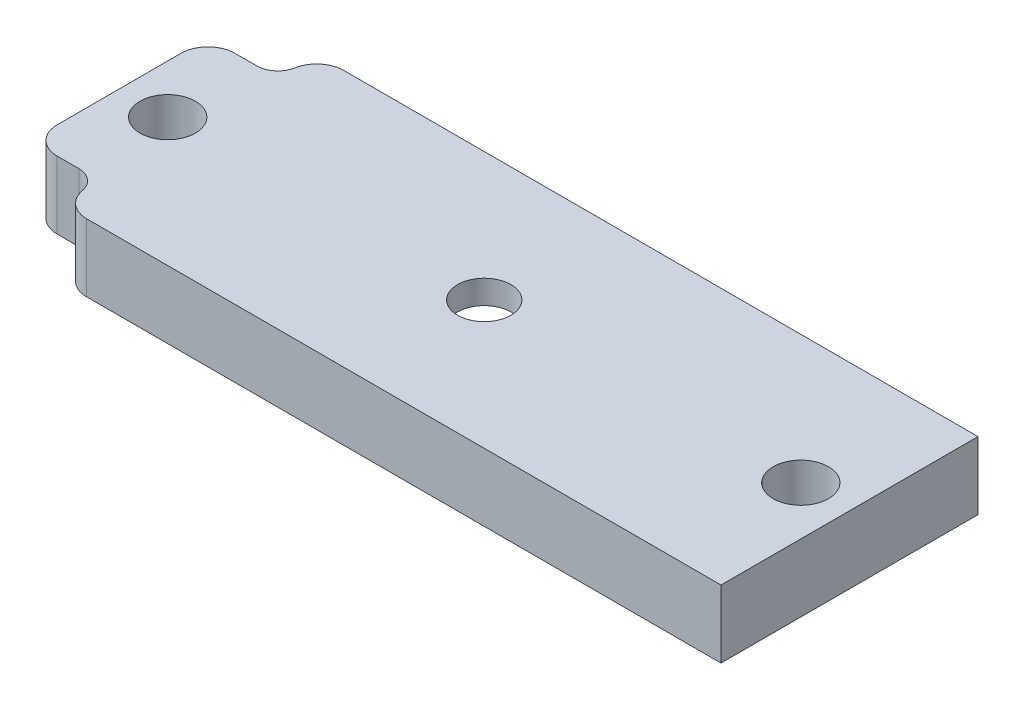
ISO-10303-21;
HEADER;
FILE_DESCRIPTION(('STEP AP214'),'2;1');
FILE_NAME('part.step','',(''),(''),'','','');
FILE_SCHEMA(('AUTOMOTIVE_DESIGN { 1 0 10303 214 1 1 1 1 }'));
ENDSEC;
DATA;
#1=APPLICATION_CONTEXT('core data for automotive mechanical design processes');
#2=APPLICATION_PROTOCOL_DEFINITION('international standard','automotive_design',2000,#1);
#3=PRODUCT_CONTEXT('',#1,'mechanical');
#4=PRODUCT('Part','Part','',(#3));
#5=PRODUCT_RELATED_PRODUCT_CATEGORY('part','',(#4));
#6=PRODUCT_DEFINITION_FORMATION('','',#4);
#7=PRODUCT_DEFINITION_CONTEXT('part definition',#1,'design');
#8=PRODUCT_DEFINITION('design','',#6,#7);
#9=PRODUCT_DEFINITION_SHAPE('','',#8);
#10=(LENGTH_UNIT() NAMED_UNIT(*) SI_UNIT(.MILLI.,.METRE.));
#11=(NAMED_UNIT(*) PLANE_ANGLE_UNIT() SI_UNIT($,.RADIAN.));
#12=(NAMED_UNIT(*) SI_UNIT($,.STERADIAN.) SOLID_ANGLE_UNIT());
#13=UNCERTAINTY_MEASURE_WITH_UNIT(LENGTH_MEASURE(1.E-05),#10,'distance_accuracy_value','');
#14=(GEOMETRIC_REPRESENTATION_CONTEXT(3) GLOBAL_UNCERTAINTY_ASSIGNED_CONTEXT((#13)) GLOBAL_UNIT_ASSIGNED_CONTEXT((#10,
#11,#12)) REPRESENTATION_CONTEXT('',''));
#15=CARTESIAN_POINT('',(0.,0.,0.));
#16=DIRECTION('',(0.,0.,1.));
#17=DIRECTION('',(1.,0.,0.));
#18=AXIS2_PLACEMENT_3D('',#15,#16,#17);
#19=CARTESIAN_POINT('',(0.,6.35,0.));
#20=DIRECTION('',(0.,-1.,0.));
#21=DIRECTION('',(0.,0.,-1.));
#22=AXIS2_PLACEMENT_3D('',#19,#20,#21);
#23=PLANE('',#22);
#24=CARTESIAN_POINT('',(34.29,6.35,-12.065));
#25=DIRECTION('',(0.,1.,0.));
#26=DIRECTION('',(0.,0.,1.));
#27=AXIS2_PLACEMENT_3D('',#24,#25,#26);
#28=CIRCLE('',#27,2.5);
#29=CARTESIAN_POINT('',(34.29,6.35,-9.565));
#30=VERTEX_POINT('',#29);
#31=EDGE_CURVE('E153',#30,#30,#28,.T.);
#32=ORIENTED_EDGE('',*,*,#31,.F.);
#33=EDGE_LOOP('',(#32));
#34=FACE_BOUND('',#33,.T.);
#35=CARTESIAN_POINT('',(4.57,6.35,-12.065));
#36=DIRECTION('',(0.,1.,0.));
#37=DIRECTION('',(0.,0.,1.));
#38=AXIS2_PLACEMENT_3D('',#35,#36,#37);
#39=CIRCLE('',#38,2.6);
#40=CARTESIAN_POINT('',(4.57,6.35,-9.465));
#41=VERTEX_POINT('',#40);
#42=EDGE_CURVE('E175',#41,#41,#39,.T.);
#43=ORIENTED_EDGE('',*,*,#42,.F.);
#44=EDGE_LOOP('',(#43));
#45=FACE_BOUND('',#44,.T.);
#46=CARTESIAN_POINT('',(64.01,6.35,-12.065));
#47=DIRECTION('',(0.,1.,0.));
#48=DIRECTION('',(0.,0.,1.));
#49=AXIS2_PLACEMENT_3D('',#46,#47,#48);
#50=CIRCLE('',#49,2.59999999999999);
#51=CARTESIAN_POINT('',(64.01,6.35,-9.46500000000001));
#52=VERTEX_POINT('',#51);
#53=EDGE_CURVE('E169',#52,#52,#50,.T.);
#54=ORIENTED_EDGE('',*,*,#53,.F.);
#55=EDGE_LOOP('',(#54));
#56=FACE_BOUND('',#55,.T.);
#57=CARTESIAN_POINT('',(4.57,6.35,-1.715));
#58=DIRECTION('',(0.,1.,0.));
#59=DIRECTION('',(0.,0.,1.));
#60=AXIS2_PLACEMENT_3D('',#57,#58,#59);
#61=CIRCLE('',#60,2.);
#62=CARTESIAN_POINT('',(4.57,6.35,-3.715));
#63=VERTEX_POINT('',#62);
#64=CARTESIAN_POINT('',(6.53670134597141,6.35,-2.07843612334802));
#65=VERTEX_POINT('',#64);
#66=EDGE_CURVE('E138',#63,#65,#61,.F.);
#67=ORIENTED_EDGE('',*,*,#66,.T.);
#68=CARTESIAN_POINT('',(9.03441205535511,6.35,-2.54));
#69=DIRECTION('',(0.,-1.,0.));
#70=DIRECTION('',(0.,0.,-1.));
#71=AXIS2_PLACEMENT_3D('',#68,#69,#70);
#72=CIRCLE('',#71,2.54);
#73=CARTESIAN_POINT('',(9.03441205535511,6.35,0.));
#74=VERTEX_POINT('',#73);
#75=EDGE_CURVE('E214',#65,#74,#72,.F.);
#76=ORIENTED_EDGE('',*,*,#75,.T.);
#77=DIRECTION('',(1.,0.,0.));
#78=VECTOR('',#77,1.);
#79=CARTESIAN_POINT('',(0.,6.35,0.));
#80=LINE('',#79,#78);
#81=CARTESIAN_POINT('',(68.58,6.35,0.));
#82=VERTEX_POINT('',#81);
#83=EDGE_CURVE('E184',#74,#82,#80,.T.);
#84=ORIENTED_EDGE('',*,*,#83,.T.);
#85=DIRECTION('',(0.,0.,-1.));
#86=VECTOR('',#85,1.);
#87=CARTESIAN_POINT('',(68.58,6.35,0.));
#88=LINE('',#87,#86);
#89=CARTESIAN_POINT('',(68.58,6.35,-24.13));
#90=VERTEX_POINT('',#89);
#91=EDGE_CURVE('E187',#82,#90,#88,.T.);
#92=ORIENTED_EDGE('',*,*,#91,.T.);
#93=DIRECTION('',(-1.,0.,0.));
#94=VECTOR('',#93,1.);
#95=CARTESIAN_POINT('',(0.,6.35,-24.13));
#96=LINE('',#95,#94);
#97=CARTESIAN_POINT('',(9.03441205535511,6.35,-24.13));
#98=VERTEX_POINT('',#97);
#99=EDGE_CURVE('E189',#90,#98,#96,.T.);
#100=ORIENTED_EDGE('',*,*,#99,.T.);
#101=CARTESIAN_POINT('',(9.03441205535511,6.35,-21.59));
#102=DIRECTION('',(0.,-1.,0.));
#103=DIRECTION('',(0.,0.,-1.));
#104=AXIS2_PLACEMENT_3D('',#101,#102,#103);
#105=CIRCLE('',#104,2.54);
#106=CARTESIAN_POINT('',(6.53670134597141,6.35,-22.051563876652));
#107=VERTEX_POINT('',#106);
#108=EDGE_CURVE('E208',#98,#107,#105,.F.);
#109=ORIENTED_EDGE('',*,*,#108,.T.);
#110=CARTESIAN_POINT('',(4.57,6.35,-22.415));
#111=DIRECTION('',(0.,1.,0.));
#112=DIRECTION('',(0.,0.,1.));
#113=AXIS2_PLACEMENT_3D('',#110,#111,#112);
#114=CIRCLE('',#113,2.);
#115=CARTESIAN_POINT('',(4.57,6.35,-20.415));
#116=VERTEX_POINT('',#115);
#117=EDGE_CURVE('E149',#116,#107,#114,.T.);
#118=ORIENTED_EDGE('',*,*,#117,.F.);
#119=DIRECTION('',(-1.,0.,0.));
#120=VECTOR('',#119,1.);
#121=CARTESIAN_POINT('',(0.,6.35,-20.415));
#122=LINE('',#121,#120);
#123=CARTESIAN_POINT('',(2.54,6.35,-20.415));
#124=VERTEX_POINT('',#123);
#125=EDGE_CURVE('E134',#116,#124,#122,.T.);
#126=ORIENTED_EDGE('',*,*,#125,.T.);
#127=CARTESIAN_POINT('',(2.54,6.35,-17.875));
#128=DIRECTION('',(0.,-1.,0.));
#129=DIRECTION('',(0.,0.,-1.));
#130=AXIS2_PLACEMENT_3D('',#127,#128,#129);
#131=CIRCLE('',#130,2.54);
#132=CARTESIAN_POINT('',(0.,6.35,-17.875));
#133=VERTEX_POINT('',#132);
#134=EDGE_CURVE('E210',#124,#133,#131,.F.);
#135=ORIENTED_EDGE('',*,*,#134,.T.);
#136=DIRECTION('',(0.,0.,1.));
#137=VECTOR('',#136,1.);
#138=CARTESIAN_POINT('',(0.,6.35,0.));
#139=LINE('',#138,#137);
#140=CARTESIAN_POINT('',(0.,6.35,-6.255));
#141=VERTEX_POINT('',#140);
#142=EDGE_CURVE('E181',#133,#141,#139,.T.);
#143=ORIENTED_EDGE('',*,*,#142,.T.);
#144=CARTESIAN_POINT('',(2.54,6.35,-6.255));
#145=DIRECTION('',(0.,-1.,0.));
#146=DIRECTION('',(0.,0.,-1.));
#147=AXIS2_PLACEMENT_3D('',#144,#145,#146);
#148=CIRCLE('',#147,2.54);
#149=CARTESIAN_POINT('',(2.54,6.35,-3.715));
#150=VERTEX_POINT('',#149);
#151=EDGE_CURVE('E212',#141,#150,#148,.F.);
#152=ORIENTED_EDGE('',*,*,#151,.T.);
#153=DIRECTION('',(-1.,0.,0.));
#154=VECTOR('',#153,1.);
#155=CARTESIAN_POINT('',(0.,6.35,-3.715));
#156=LINE('',#155,#154);
#157=EDGE_CURVE('E161',#63,#150,#156,.T.);
#158=ORIENTED_EDGE('',*,*,#157,.F.);
#159=EDGE_LOOP('',(#67,#76,#84,#92,#100,#109,#118,#126,#135,#143,#152,#158));
#160=FACE_BOUND('',#159,.T.);
#161=ADVANCED_FACE('F33',(#34,#45,#56,#160),#23,.F.);
#162=CARTESIAN_POINT('',(0.,0.,0.));
#163=DIRECTION('',(0.,-1.,0.));
#164=DIRECTION('',(0.,0.,-1.));
#165=AXIS2_PLACEMENT_3D('',#162,#163,#164);
#166=PLANE('',#165);
#167=CARTESIAN_POINT('',(34.29,0.,-12.065));
#168=DIRECTION('',(0.,1.,0.));
#169=DIRECTION('',(0.,0.,1.));
#170=AXIS2_PLACEMENT_3D('',#167,#168,#169);
#171=CIRCLE('',#170,10.065);
#172=CARTESIAN_POINT('',(34.29,0.,-2.));
#173=VERTEX_POINT('',#172);
#174=EDGE_CURVE('E435',#173,#173,#171,.T.);
#175=ORIENTED_EDGE('',*,*,#174,.T.);
#176=EDGE_LOOP('',(#175));
#177=FACE_BOUND('',#176,.T.);
#178=CARTESIAN_POINT('',(4.57,0.,-12.065));
#179=DIRECTION('',(0.,1.,0.));
#180=DIRECTION('',(0.,0.,1.));
#181=AXIS2_PLACEMENT_3D('',#178,#179,#180);
#182=CIRCLE('',#181,2.6);
#183=CARTESIAN_POINT('',(4.57,0.,-9.465));
#184=VERTEX_POINT('',#183);
#185=EDGE_CURVE('E172',#184,#184,#182,.T.);
#186=ORIENTED_EDGE('',*,*,#185,.T.);
#187=EDGE_LOOP('',(#186));
#188=FACE_BOUND('',#187,.T.);
#189=CARTESIAN_POINT('',(64.01,0.,-12.065));
#190=DIRECTION('',(0.,1.,0.));
#191=DIRECTION('',(0.,0.,1.));
#192=AXIS2_PLACEMENT_3D('',#189,#190,#191);
#193=CIRCLE('',#192,2.59999999999999);
#194=CARTESIAN_POINT('',(64.01,0.,-9.46500000000001));
#195=VERTEX_POINT('',#194);
#196=EDGE_CURVE('E168',#195,#195,#193,.T.);
#197=ORIENTED_EDGE('',*,*,#196,.T.);
#198=EDGE_LOOP('',(#197));
#199=FACE_BOUND('',#198,.T.);
#200=DIRECTION('',(1.,0.,0.));
#201=VECTOR('',#200,1.);
#202=CARTESIAN_POINT('',(0.,0.,0.));
#203=LINE('',#202,#201);
#204=CARTESIAN_POINT('',(9.03441205535511,0.,0.));
#205=VERTEX_POINT('',#204);
#206=CARTESIAN_POINT('',(68.58,0.,0.));
#207=VERTEX_POINT('',#206);
#208=EDGE_CURVE('E195',#205,#207,#203,.T.);
#209=ORIENTED_EDGE('',*,*,#208,.F.);
#210=CARTESIAN_POINT('',(9.03441205535511,0.,-2.54));
#211=DIRECTION('',(0.,-1.,0.));
#212=DIRECTION('',(0.,0.,-1.));
#213=AXIS2_PLACEMENT_3D('',#210,#211,#212);
#214=CIRCLE('',#213,2.54);
#215=CARTESIAN_POINT('',(6.53670134597141,0.,-2.07843612334802));
#216=VERTEX_POINT('',#215);
#217=EDGE_CURVE('E222',#205,#216,#214,.T.);
#218=ORIENTED_EDGE('',*,*,#217,.T.);
#219=CARTESIAN_POINT('',(4.57,0.,-1.715));
#220=DIRECTION('',(0.,1.,0.));
#221=DIRECTION('',(0.,0.,1.));
#222=AXIS2_PLACEMENT_3D('',#219,#220,#221);
#223=CIRCLE('',#222,2.);
#224=CARTESIAN_POINT('',(4.57,0.,-3.715));
#225=VERTEX_POINT('',#224);
#226=EDGE_CURVE('E157',#225,#216,#223,.F.);
#227=ORIENTED_EDGE('',*,*,#226,.F.);
#228=DIRECTION('',(-1.,0.,0.));
#229=VECTOR('',#228,1.);
#230=CARTESIAN_POINT('',(0.,0.,-3.715));
#231=LINE('',#230,#229);
#232=CARTESIAN_POINT('',(2.54,0.,-3.715));
#233=VERTEX_POINT('',#232);
#234=EDGE_CURVE('E160',#225,#233,#231,.T.);
#235=ORIENTED_EDGE('',*,*,#234,.T.);
#236=CARTESIAN_POINT('',(2.54,0.,-6.255));
#237=DIRECTION('',(0.,-1.,0.));
#238=DIRECTION('',(0.,0.,-1.));
#239=AXIS2_PLACEMENT_3D('',#236,#237,#238);
#240=CIRCLE('',#239,2.54);
#241=CARTESIAN_POINT('',(0.,0.,-6.255));
#242=VERTEX_POINT('',#241);
#243=EDGE_CURVE('E220',#233,#242,#240,.T.);
#244=ORIENTED_EDGE('',*,*,#243,.T.);
#245=DIRECTION('',(0.,0.,1.));
#246=VECTOR('',#245,1.);
#247=CARTESIAN_POINT('',(0.,0.,0.));
#248=LINE('',#247,#246);
#249=CARTESIAN_POINT('',(0.,0.,-17.875));
#250=VERTEX_POINT('',#249);
#251=EDGE_CURVE('E178',#250,#242,#248,.T.);
#252=ORIENTED_EDGE('',*,*,#251,.F.);
#253=CARTESIAN_POINT('',(2.54,0.,-17.875));
#254=DIRECTION('',(0.,-1.,0.));
#255=DIRECTION('',(0.,0.,-1.));
#256=AXIS2_PLACEMENT_3D('',#253,#254,#255);
#257=CIRCLE('',#256,2.54);
#258=CARTESIAN_POINT('',(2.54,0.,-20.415));
#259=VERTEX_POINT('',#258);
#260=EDGE_CURVE('E148',#250,#259,#257,.T.);
#261=ORIENTED_EDGE('',*,*,#260,.T.);
#262=DIRECTION('',(-1.,0.,0.));
#263=VECTOR('',#262,1.);
#264=CARTESIAN_POINT('',(0.,0.,-20.415));
#265=LINE('',#264,#263);
#266=CARTESIAN_POINT('',(4.57,0.,-20.415));
#267=VERTEX_POINT('',#266);
#268=EDGE_CURVE('E131',#267,#259,#265,.T.);
#269=ORIENTED_EDGE('',*,*,#268,.F.);
#270=CARTESIAN_POINT('',(4.57,0.,-22.415));
#271=DIRECTION('',(0.,1.,0.));
#272=DIRECTION('',(0.,0.,1.));
#273=AXIS2_PLACEMENT_3D('',#270,#271,#272);
#274=CIRCLE('',#273,2.);
#275=CARTESIAN_POINT('',(6.53670134597141,0.,-22.051563876652));
#276=VERTEX_POINT('',#275);
#277=EDGE_CURVE('E139',#267,#276,#274,.T.);
#278=ORIENTED_EDGE('',*,*,#277,.T.);
#279=CARTESIAN_POINT('',(9.03441205535511,0.,-21.59));
#280=DIRECTION('',(0.,-1.,0.));
#281=DIRECTION('',(0.,0.,-1.));
#282=AXIS2_PLACEMENT_3D('',#279,#280,#281);
#283=CIRCLE('',#282,2.54);
#284=CARTESIAN_POINT('',(9.03441205535511,0.,-24.13));
#285=VERTEX_POINT('',#284);
#286=EDGE_CURVE('E57',#276,#285,#283,.T.);
#287=ORIENTED_EDGE('',*,*,#286,.T.);
#288=DIRECTION('',(-1.,0.,0.));
#289=VECTOR('',#288,1.);
#290=CARTESIAN_POINT('',(0.,0.,-24.13));
#291=LINE('',#290,#289);
#292=CARTESIAN_POINT('',(68.58,0.,-24.13));
#293=VERTEX_POINT('',#292);
#294=EDGE_CURVE('E185',#293,#285,#291,.T.);
#295=ORIENTED_EDGE('',*,*,#294,.F.);
#296=DIRECTION('',(0.,0.,-1.));
#297=VECTOR('',#296,1.);
#298=CARTESIAN_POINT('',(68.58,0.,0.));
#299=LINE('',#298,#297);
#300=EDGE_CURVE('E197',#207,#293,#299,.T.);
#301=ORIENTED_EDGE('',*,*,#300,.F.);
#302=EDGE_LOOP('',(#209,#218,#227,#235,#244,#252,#261,#269,#278,#287,#295,#301));
#303=FACE_BOUND('',#302,.T.);
#304=ADVANCED_FACE('F145',(#177,#188,#199,#303),#166,.T.);
#305=CARTESIAN_POINT('',(0.,6.35,0.));
#306=DIRECTION('',(1.,0.,0.));
#307=DIRECTION('',(0.,0.,-1.));
#308=AXIS2_PLACEMENT_3D('',#305,#306,#307);
#309=PLANE('',#308);
#310=ORIENTED_EDGE('',*,*,#251,.T.);
#311=DIRECTION('',(0.,1.,0.));
#312=VECTOR('',#311,1.);
#313=CARTESIAN_POINT('',(0.,6.35,-6.255));
#314=LINE('',#313,#312);
#315=EDGE_CURVE('E226',#242,#141,#314,.T.);
#316=ORIENTED_EDGE('',*,*,#315,.T.);
#317=ORIENTED_EDGE('',*,*,#142,.F.);
#318=DIRECTION('',(0.,1.,0.));
#319=VECTOR('',#318,1.);
#320=CARTESIAN_POINT('',(0.,0.,-17.875));
#321=LINE('',#320,#319);
#322=EDGE_CURVE('E224',#133,#250,#321,.F.);
#323=ORIENTED_EDGE('',*,*,#322,.T.);
#324=EDGE_LOOP('',(#310,#316,#317,#323));
#325=FACE_BOUND('',#324,.T.);
#326=ADVANCED_FACE('F263',(#325),#309,.F.);
#327=CARTESIAN_POINT('',(0.,6.35,0.));
#328=DIRECTION('',(0.,0.,-1.));
#329=DIRECTION('',(-1.,0.,0.));
#330=AXIS2_PLACEMENT_3D('',#327,#328,#329);
#331=PLANE('',#330);
#332=ORIENTED_EDGE('',*,*,#83,.F.);
#333=DIRECTION('',(0.,-1.,0.));
#334=VECTOR('',#333,1.);
#335=CARTESIAN_POINT('',(9.03441205535511,0.,0.));
#336=LINE('',#335,#334);
#337=EDGE_CURVE('E216',#74,#205,#336,.T.);
#338=ORIENTED_EDGE('',*,*,#337,.T.);
#339=ORIENTED_EDGE('',*,*,#208,.T.);
#340=DIRECTION('',(0.,-1.,0.));
#341=VECTOR('',#340,1.);
#342=CARTESIAN_POINT('',(68.58,6.35,0.));
#343=LINE('',#342,#341);
#344=EDGE_CURVE('E202',#82,#207,#343,.T.);
#345=ORIENTED_EDGE('',*,*,#344,.F.);
#346=EDGE_LOOP('',(#332,#338,#339,#345));
#347=FACE_BOUND('',#346,.T.);
#348=ADVANCED_FACE('F295',(#347),#331,.F.);
#349=CARTESIAN_POINT('',(68.58,6.35,0.));
#350=DIRECTION('',(-1.,0.,0.));
#351=DIRECTION('',(0.,0.,1.));
#352=AXIS2_PLACEMENT_3D('',#349,#350,#351);
#353=PLANE('',#352);
#354=ORIENTED_EDGE('',*,*,#300,.T.);
#355=DIRECTION('',(0.,-1.,0.));
#356=VECTOR('',#355,1.);
#357=CARTESIAN_POINT('',(68.58,6.35,-24.13));
#358=LINE('',#357,#356);
#359=EDGE_CURVE('E192',#90,#293,#358,.T.);
#360=ORIENTED_EDGE('',*,*,#359,.F.);
#361=ORIENTED_EDGE('',*,*,#91,.F.);
#362=ORIENTED_EDGE('',*,*,#344,.T.);
#363=EDGE_LOOP('',(#354,#360,#361,#362));
#364=FACE_BOUND('',#363,.T.);
#365=ADVANCED_FACE('F244',(#364),#353,.F.);
#366=CARTESIAN_POINT('',(0.,6.35,-24.13));
#367=DIRECTION('',(0.,0.,1.));
#368=DIRECTION('',(1.,0.,0.));
#369=AXIS2_PLACEMENT_3D('',#366,#367,#368);
#370=PLANE('',#369);
#371=ORIENTED_EDGE('',*,*,#294,.T.);
#372=DIRECTION('',(0.,1.,0.));
#373=VECTOR('',#372,1.);
#374=CARTESIAN_POINT('',(9.03441205535511,6.35,-24.13));
#375=LINE('',#374,#373);
#376=EDGE_CURVE('E42',#285,#98,#375,.T.);
#377=ORIENTED_EDGE('',*,*,#376,.T.);
#378=ORIENTED_EDGE('',*,*,#99,.F.);
#379=ORIENTED_EDGE('',*,*,#359,.T.);
#380=EDGE_LOOP('',(#371,#377,#378,#379));
#381=FACE_BOUND('',#380,.T.);
#382=ADVANCED_FACE('F236',(#381),#370,.F.);
#383=CARTESIAN_POINT('',(4.57,6.35,-12.065));
#384=DIRECTION('',(0.,-1.,0.));
#385=DIRECTION('',(0.,0.,-1.));
#386=AXIS2_PLACEMENT_3D('',#383,#384,#385);
#387=CYLINDRICAL_SURFACE('',#386,2.6);
#388=ORIENTED_EDGE('',*,*,#42,.T.);
#389=EDGE_LOOP('',(#388));
#390=FACE_BOUND('',#389,.T.);
#391=ORIENTED_EDGE('',*,*,#185,.F.);
#392=EDGE_LOOP('',(#391));
#393=FACE_BOUND('',#392,.T.);
#394=ADVANCED_FACE('F288',(#390,#393),#387,.F.);
#395=CARTESIAN_POINT('',(64.01,6.35,-12.065));
#396=DIRECTION('',(0.,-1.,0.));
#397=DIRECTION('',(0.,0.,-1.));
#398=AXIS2_PLACEMENT_3D('',#395,#396,#397);
#399=CYLINDRICAL_SURFACE('',#398,2.59999999999999);
#400=ORIENTED_EDGE('',*,*,#53,.T.);
#401=EDGE_LOOP('',(#400));
#402=FACE_BOUND('',#401,.T.);
#403=ORIENTED_EDGE('',*,*,#196,.F.);
#404=EDGE_LOOP('',(#403));
#405=FACE_BOUND('',#404,.T.);
#406=ADVANCED_FACE('F344',(#402,#405),#399,.F.);
#407=CARTESIAN_POINT('',(4.57,0.,-1.715));
#408=DIRECTION('',(0.,1.,0.));
#409=DIRECTION('',(0.,0.,1.));
#410=AXIS2_PLACEMENT_3D('',#407,#408,#409);
#411=CYLINDRICAL_SURFACE('',#410,2.);
#412=ORIENTED_EDGE('',*,*,#226,.T.);
#413=DIRECTION('',(0.,1.,0.));
#414=VECTOR('',#413,1.);
#415=CARTESIAN_POINT('',(6.53670134597141,0.,-2.07843612334802));
#416=LINE('',#415,#414);
#417=EDGE_CURVE('E205',#216,#65,#416,.T.);
#418=ORIENTED_EDGE('',*,*,#417,.T.);
#419=ORIENTED_EDGE('',*,*,#66,.F.);
#420=DIRECTION('',(0.,1.,0.));
#421=VECTOR('',#420,1.);
#422=CARTESIAN_POINT('',(4.57,0.,-3.715));
#423=LINE('',#422,#421);
#424=EDGE_CURVE('E163',#225,#63,#423,.T.);
#425=ORIENTED_EDGE('',*,*,#424,.F.);
#426=EDGE_LOOP('',(#412,#418,#419,#425));
#427=FACE_BOUND('',#426,.T.);
#428=ADVANCED_FACE('F255',(#427),#411,.F.);
#429=CARTESIAN_POINT('',(0.,0.,-3.715));
#430=DIRECTION('',(0.,0.,-1.));
#431=DIRECTION('',(-1.,0.,0.));
#432=AXIS2_PLACEMENT_3D('',#429,#430,#431);
#433=PLANE('',#432);
#434=ORIENTED_EDGE('',*,*,#157,.T.);
#435=DIRECTION('',(0.,1.,0.));
#436=VECTOR('',#435,1.);
#437=CARTESIAN_POINT('',(2.54,0.,-3.715));
#438=LINE('',#437,#436);
#439=EDGE_CURVE('E49',#150,#233,#438,.F.);
#440=ORIENTED_EDGE('',*,*,#439,.T.);
#441=ORIENTED_EDGE('',*,*,#234,.F.);
#442=ORIENTED_EDGE('',*,*,#424,.T.);
#443=EDGE_LOOP('',(#434,#440,#441,#442));
#444=FACE_BOUND('',#443,.T.);
#445=ADVANCED_FACE('F257',(#444),#433,.F.);
#446=CARTESIAN_POINT('',(0.,0.,-20.415));
#447=DIRECTION('',(0.,0.,-1.));
#448=DIRECTION('',(-1.,0.,0.));
#449=AXIS2_PLACEMENT_3D('',#446,#447,#448);
#450=PLANE('',#449);
#451=ORIENTED_EDGE('',*,*,#268,.T.);
#452=DIRECTION('',(0.,1.,0.));
#453=VECTOR('',#452,1.);
#454=CARTESIAN_POINT('',(2.54,6.35,-20.415));
#455=LINE('',#454,#453);
#456=EDGE_CURVE('E230',#259,#124,#455,.T.);
#457=ORIENTED_EDGE('',*,*,#456,.T.);
#458=ORIENTED_EDGE('',*,*,#125,.F.);
#459=DIRECTION('',(0.,1.,0.));
#460=VECTOR('',#459,1.);
#461=CARTESIAN_POINT('',(4.57,0.,-20.415));
#462=LINE('',#461,#460);
#463=EDGE_CURVE('E126',#267,#116,#462,.T.);
#464=ORIENTED_EDGE('',*,*,#463,.F.);
#465=EDGE_LOOP('',(#451,#457,#458,#464));
#466=FACE_BOUND('',#465,.T.);
#467=ADVANCED_FACE('F128',(#466),#450,.T.);
#468=CARTESIAN_POINT('',(4.57,0.,-22.415));
#469=DIRECTION('',(0.,1.,0.));
#470=DIRECTION('',(0.,0.,1.));
#471=AXIS2_PLACEMENT_3D('',#468,#469,#470);
#472=CYLINDRICAL_SURFACE('',#471,2.);
#473=ORIENTED_EDGE('',*,*,#117,.T.);
#474=DIRECTION('',(0.,1.,0.));
#475=VECTOR('',#474,1.);
#476=CARTESIAN_POINT('',(6.53670134597141,0.,-22.051563876652));
#477=LINE('',#476,#475);
#478=EDGE_CURVE('E11',#107,#276,#477,.F.);
#479=ORIENTED_EDGE('',*,*,#478,.T.);
#480=ORIENTED_EDGE('',*,*,#277,.F.);
#481=ORIENTED_EDGE('',*,*,#463,.T.);
#482=EDGE_LOOP('',(#473,#479,#480,#481));
#483=FACE_BOUND('',#482,.T.);
#484=ADVANCED_FACE('F141',(#483),#472,.F.);
#485=CARTESIAN_POINT('',(9.03441205535511,0.,-2.54));
#486=DIRECTION('',(0.,1.,0.));
#487=DIRECTION('',(0.,0.,1.));
#488=AXIS2_PLACEMENT_3D('',#485,#486,#487);
#489=CYLINDRICAL_SURFACE('',#488,2.54);
#490=ORIENTED_EDGE('',*,*,#217,.F.);
#491=ORIENTED_EDGE('',*,*,#337,.F.);
#492=ORIENTED_EDGE('',*,*,#75,.F.);
#493=ORIENTED_EDGE('',*,*,#417,.F.);
#494=EDGE_LOOP('',(#490,#491,#492,#493));
#495=FACE_BOUND('',#494,.T.);
#496=ADVANCED_FACE('F252',(#495),#489,.T.);
#497=CARTESIAN_POINT('',(2.54,6.35,-6.255));
#498=DIRECTION('',(0.,1.,0.));
#499=DIRECTION('',(0.,0.,1.));
#500=AXIS2_PLACEMENT_3D('',#497,#498,#499);
#501=CYLINDRICAL_SURFACE('',#500,2.54);
#502=ORIENTED_EDGE('',*,*,#243,.F.);
#503=ORIENTED_EDGE('',*,*,#439,.F.);
#504=ORIENTED_EDGE('',*,*,#151,.F.);
#505=ORIENTED_EDGE('',*,*,#315,.F.);
#506=EDGE_LOOP('',(#502,#503,#504,#505));
#507=FACE_BOUND('',#506,.T.);
#508=ADVANCED_FACE('F260',(#507),#501,.T.);
#509=CARTESIAN_POINT('',(2.54,0.,-17.875));
#510=DIRECTION('',(0.,-1.,0.));
#511=DIRECTION('',(0.,0.,-1.));
#512=AXIS2_PLACEMENT_3D('',#509,#510,#511);
#513=CYLINDRICAL_SURFACE('',#512,2.54);
#514=ORIENTED_EDGE('',*,*,#260,.F.);
#515=ORIENTED_EDGE('',*,*,#322,.F.);
#516=ORIENTED_EDGE('',*,*,#134,.F.);
#517=ORIENTED_EDGE('',*,*,#456,.F.);
#518=EDGE_LOOP('',(#514,#515,#516,#517));
#519=FACE_BOUND('',#518,.T.);
#520=ADVANCED_FACE('F267',(#519),#513,.T.);
#521=CARTESIAN_POINT('',(9.03441205535511,0.,-21.59));
#522=DIRECTION('',(0.,1.,0.));
#523=DIRECTION('',(0.,0.,1.));
#524=AXIS2_PLACEMENT_3D('',#521,#522,#523);
#525=CYLINDRICAL_SURFACE('',#524,2.54);
#526=ORIENTED_EDGE('',*,*,#286,.F.);
#527=ORIENTED_EDGE('',*,*,#478,.F.);
#528=ORIENTED_EDGE('',*,*,#108,.F.);
#529=ORIENTED_EDGE('',*,*,#376,.F.);
#530=EDGE_LOOP('',(#526,#527,#528,#529));
#531=FACE_BOUND('',#530,.T.);
#532=ADVANCED_FACE('F35',(#531),#525,.T.);
#533=CARTESIAN_POINT('',(34.29,0.,-12.065));
#534=DIRECTION('',(0.,1.,0.));
#535=DIRECTION('',(0.,0.,1.));
#536=AXIS2_PLACEMENT_3D('',#533,#534,#535);
#537=CYLINDRICAL_SURFACE('',#536,2.5);
#538=CARTESIAN_POINT('',(34.29,4.12198361764232,-12.065));
#539=DIRECTION('',(0.,-1.,0.));
#540=DIRECTION('',(0.,0.,-1.));
#541=AXIS2_PLACEMENT_3D('',#538,#539,#540);
#542=CIRCLE('',#541,2.5);
#543=CARTESIAN_POINT('',(34.29,4.12198361764232,-14.565));
#544=VERTEX_POINT('',#543);
#545=EDGE_CURVE('E37',#544,#544,#542,.T.);
#546=ORIENTED_EDGE('',*,*,#545,.T.);
#547=EDGE_LOOP('',(#546));
#548=FACE_BOUND('',#547,.T.);
#549=ORIENTED_EDGE('',*,*,#31,.T.);
#550=EDGE_LOOP('',(#549));
#551=FACE_BOUND('',#550,.T.);
#552=ADVANCED_FACE('F269',(#548,#551),#537,.F.);
#553=CARTESIAN_POINT('',(34.29,-9.46916379310344,-12.065));
#554=DIRECTION('',(0.,1.,0.));
#555=DIRECTION('',(0.,0.,-1.));
#556=AXIS2_PLACEMENT_3D('',#553,#554,#555);
#557=SPHERICAL_SURFACE('',#556,13.8191637931034);
#558=ORIENTED_EDGE('',*,*,#174,.F.);
#559=EDGE_LOOP('',(#558));
#560=FACE_BOUND('',#559,.T.);
#561=ORIENTED_EDGE('',*,*,#545,.F.);
#562=EDGE_LOOP('',(#561));
#563=FACE_BOUND('',#562,.T.);
#564=ADVANCED_FACE('F274',(#560,#563),#557,.F.);
#565=CLOSED_SHELL('',(#161,#304,#326,#348,#365,#382,#394,#406,#428,#445,#467,#484,#496,#508,
#520,#532,#552,#564));
#566=MANIFOLD_SOLID_BREP('B2',#565);
#567=ADVANCED_BREP_SHAPE_REPRESENTATION('',(#18,#566),#14);
#568=SHAPE_DEFINITION_REPRESENTATION(#9,#567);
ENDSEC;
END-ISO-10303-21;
